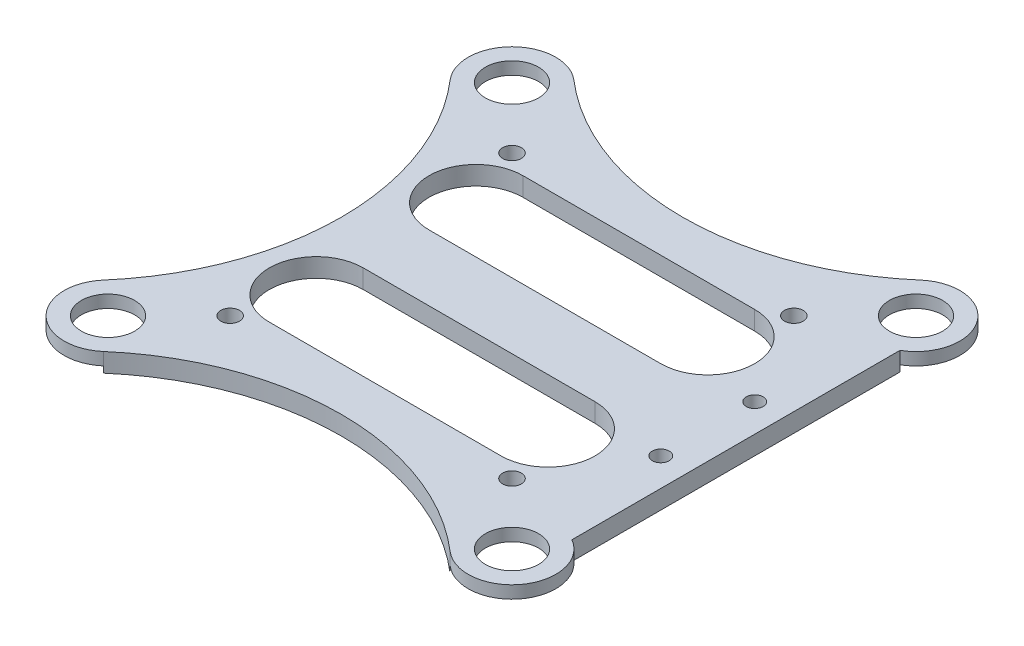
ISO-10303-21;
HEADER;
FILE_DESCRIPTION(('STEP AP214'),'2;1');
FILE_NAME('part.step','',(''),(''),'','','');
FILE_SCHEMA(('AUTOMOTIVE_DESIGN { 1 0 10303 214 1 1 1 1 }'));
ENDSEC;
DATA;
#1=APPLICATION_CONTEXT('core data for automotive mechanical design processes');
#2=APPLICATION_PROTOCOL_DEFINITION('international standard','automotive_design',2000,#1);
#3=PRODUCT_CONTEXT('',#1,'mechanical');
#4=PRODUCT('Part','Part','',(#3));
#5=PRODUCT_RELATED_PRODUCT_CATEGORY('part','',(#4));
#6=PRODUCT_DEFINITION_FORMATION('','',#4);
#7=PRODUCT_DEFINITION_CONTEXT('part definition',#1,'design');
#8=PRODUCT_DEFINITION('design','',#6,#7);
#9=PRODUCT_DEFINITION_SHAPE('','',#8);
#10=(LENGTH_UNIT() NAMED_UNIT(*) SI_UNIT(.MILLI.,.METRE.));
#11=(NAMED_UNIT(*) PLANE_ANGLE_UNIT() SI_UNIT($,.RADIAN.));
#12=(NAMED_UNIT(*) SI_UNIT($,.STERADIAN.) SOLID_ANGLE_UNIT());
#13=UNCERTAINTY_MEASURE_WITH_UNIT(LENGTH_MEASURE(1.E-05),#10,'distance_accuracy_value','');
#14=(GEOMETRIC_REPRESENTATION_CONTEXT(3) GLOBAL_UNCERTAINTY_ASSIGNED_CONTEXT((#13)) GLOBAL_UNIT_ASSIGNED_CONTEXT((#10,
#11,#12)) REPRESENTATION_CONTEXT('',''));
#15=CARTESIAN_POINT('',(0.,0.,0.));
#16=DIRECTION('',(0.,0.,1.));
#17=DIRECTION('',(1.,0.,0.));
#18=AXIS2_PLACEMENT_3D('',#15,#16,#17);
#19=CARTESIAN_POINT('',(-32.25,0.,-32.25));
#20=DIRECTION('',(0.,1.,0.));
#21=DIRECTION('',(0.,0.,1.));
#22=AXIS2_PLACEMENT_3D('',#19,#20,#21);
#23=CYLINDRICAL_SURFACE('',#22,7.);
#24=CARTESIAN_POINT('',(-32.25,0.,-32.25));
#25=DIRECTION('',(0.,1.,0.));
#26=DIRECTION('',(0.,0.,1.));
#27=AXIS2_PLACEMENT_3D('',#24,#25,#26);
#28=CIRCLE('',#27,7.);
#29=CARTESIAN_POINT('',(-27.6742280285036,0.,-37.5473871733967));
#30=VERTEX_POINT('',#29);
#31=CARTESIAN_POINT('',(-37.5473871733967,0.,-27.6742280285036));
#32=VERTEX_POINT('',#31);
#33=EDGE_CURVE('E353',#30,#32,#28,.F.);
#34=ORIENTED_EDGE('',*,*,#33,.T.);
#35=DIRECTION('',(0.,1.,0.));
#36=VECTOR('',#35,1.);
#37=CARTESIAN_POINT('',(-37.5473871733967,0.,-27.6742280285036));
#38=LINE('',#37,#36);
#39=CARTESIAN_POINT('',(-37.5473871733967,1.,-27.6742280285036));
#40=VERTEX_POINT('',#39);
#41=EDGE_CURVE('E231',#40,#32,#38,.F.);
#42=ORIENTED_EDGE('',*,*,#41,.F.);
#43=CARTESIAN_POINT('',(-32.25,1.,-32.25));
#44=DIRECTION('',(0.,1.,0.));
#45=DIRECTION('',(0.,0.,1.));
#46=AXIS2_PLACEMENT_3D('',#43,#44,#45);
#47=CIRCLE('',#46,7.);
#48=CARTESIAN_POINT('',(-27.6742280285036,1.,-37.5473871733967));
#49=VERTEX_POINT('',#48);
#50=EDGE_CURVE('E172',#49,#40,#47,.F.);
#51=ORIENTED_EDGE('',*,*,#50,.F.);
#52=DIRECTION('',(0.,1.,0.));
#53=VECTOR('',#52,1.);
#54=CARTESIAN_POINT('',(-27.6742280285036,0.,-37.5473871733967));
#55=LINE('',#54,#53);
#56=EDGE_CURVE('E164',#30,#49,#55,.T.);
#57=ORIENTED_EDGE('',*,*,#56,.F.);
#58=EDGE_LOOP('',(#34,#42,#51,#57));
#59=FACE_BOUND('',#58,.T.);
#60=ADVANCED_FACE('F17',(#59),#23,.F.);
#61=CARTESIAN_POINT('',(-32.25,0.,32.25));
#62=DIRECTION('',(0.,1.,0.));
#63=DIRECTION('',(0.,0.,1.));
#64=AXIS2_PLACEMENT_3D('',#61,#62,#63);
#65=CYLINDRICAL_SURFACE('',#64,7.);
#66=CARTESIAN_POINT('',(-32.25,1.,32.25));
#67=DIRECTION('',(0.,1.,0.));
#68=DIRECTION('',(0.,0.,1.));
#69=AXIS2_PLACEMENT_3D('',#66,#67,#68);
#70=CIRCLE('',#69,7.);
#71=CARTESIAN_POINT('',(-37.5473871733967,1.,27.6742280285035));
#72=VERTEX_POINT('',#71);
#73=CARTESIAN_POINT('',(-27.6742280285036,1.,37.5473871733967));
#74=VERTEX_POINT('',#73);
#75=EDGE_CURVE('E20',#72,#74,#70,.F.);
#76=ORIENTED_EDGE('',*,*,#75,.F.);
#77=DIRECTION('',(0.,1.,0.));
#78=VECTOR('',#77,1.);
#79=CARTESIAN_POINT('',(-37.5473871733967,0.,27.6742280285035));
#80=LINE('',#79,#78);
#81=CARTESIAN_POINT('',(-37.5473871733967,0.,27.6742280285035));
#82=VERTEX_POINT('',#81);
#83=EDGE_CURVE('E151',#82,#72,#80,.T.);
#84=ORIENTED_EDGE('',*,*,#83,.F.);
#85=CARTESIAN_POINT('',(-32.25,0.,32.25));
#86=DIRECTION('',(0.,1.,0.));
#87=DIRECTION('',(0.,0.,1.));
#88=AXIS2_PLACEMENT_3D('',#85,#86,#87);
#89=CIRCLE('',#88,7.);
#90=CARTESIAN_POINT('',(-27.6742280285036,0.,37.5473871733967));
#91=VERTEX_POINT('',#90);
#92=EDGE_CURVE('E351',#82,#91,#89,.F.);
#93=ORIENTED_EDGE('',*,*,#92,.T.);
#94=DIRECTION('',(0.,1.,0.));
#95=VECTOR('',#94,1.);
#96=CARTESIAN_POINT('',(-27.6742280285036,0.,37.5473871733967));
#97=LINE('',#96,#95);
#98=EDGE_CURVE('E163',#74,#91,#97,.F.);
#99=ORIENTED_EDGE('',*,*,#98,.F.);
#100=EDGE_LOOP('',(#76,#84,#93,#99));
#101=FACE_BOUND('',#100,.T.);
#102=ADVANCED_FACE('F169',(#101),#65,.F.);
#103=CARTESIAN_POINT('',(32.25,0.,32.25));
#104=DIRECTION('',(0.,1.,0.));
#105=DIRECTION('',(0.,0.,1.));
#106=AXIS2_PLACEMENT_3D('',#103,#104,#105);
#107=CYLINDRICAL_SURFACE('',#106,7.);
#108=CARTESIAN_POINT('',(32.25,1.,32.25));
#109=DIRECTION('',(0.,1.,0.));
#110=DIRECTION('',(0.,0.,1.));
#111=AXIS2_PLACEMENT_3D('',#108,#109,#110);
#112=CIRCLE('',#111,7.);
#113=CARTESIAN_POINT('',(27.6742280285036,1.,37.5473871733967));
#114=VERTEX_POINT('',#113);
#115=CARTESIAN_POINT('',(35.75,1.,26.1878221735089));
#116=VERTEX_POINT('',#115);
#117=EDGE_CURVE('E359',#114,#116,#112,.F.);
#118=ORIENTED_EDGE('',*,*,#117,.F.);
#119=DIRECTION('',(0.,1.,0.));
#120=VECTOR('',#119,1.);
#121=CARTESIAN_POINT('',(27.6742280285036,0.,37.5473871733967));
#122=LINE('',#121,#120);
#123=CARTESIAN_POINT('',(27.6742280285036,0.,37.5473871733967));
#124=VERTEX_POINT('',#123);
#125=EDGE_CURVE('E228',#124,#114,#122,.T.);
#126=ORIENTED_EDGE('',*,*,#125,.F.);
#127=CARTESIAN_POINT('',(32.25,0.,32.25));
#128=DIRECTION('',(0.,1.,0.));
#129=DIRECTION('',(0.,0.,1.));
#130=AXIS2_PLACEMENT_3D('',#127,#128,#129);
#131=CIRCLE('',#130,7.);
#132=CARTESIAN_POINT('',(35.75,0.,26.1878221735089));
#133=VERTEX_POINT('',#132);
#134=EDGE_CURVE('E348',#124,#133,#131,.F.);
#135=ORIENTED_EDGE('',*,*,#134,.T.);
#136=DIRECTION('',(0.,1.,0.));
#137=VECTOR('',#136,1.);
#138=CARTESIAN_POINT('',(35.75,0.,26.1878221735089));
#139=LINE('',#138,#137);
#140=EDGE_CURVE('E225',#116,#133,#139,.F.);
#141=ORIENTED_EDGE('',*,*,#140,.F.);
#142=EDGE_LOOP('',(#118,#126,#135,#141));
#143=FACE_BOUND('',#142,.T.);
#144=ADVANCED_FACE('F718',(#143),#107,.F.);
#145=CARTESIAN_POINT('',(32.25,0.,-32.25));
#146=DIRECTION('',(0.,1.,0.));
#147=DIRECTION('',(0.,0.,1.));
#148=AXIS2_PLACEMENT_3D('',#145,#146,#147);
#149=CYLINDRICAL_SURFACE('',#148,7.);
#150=CARTESIAN_POINT('',(32.25,0.,-32.25));
#151=DIRECTION('',(0.,1.,0.));
#152=DIRECTION('',(0.,0.,1.));
#153=AXIS2_PLACEMENT_3D('',#150,#151,#152);
#154=CIRCLE('',#153,7.);
#155=CARTESIAN_POINT('',(35.75,0.,-26.1878221735089));
#156=VERTEX_POINT('',#155);
#157=CARTESIAN_POINT('',(27.6742280285036,0.,-37.5473871733967));
#158=VERTEX_POINT('',#157);
#159=EDGE_CURVE('E222',#156,#158,#154,.F.);
#160=ORIENTED_EDGE('',*,*,#159,.T.);
#161=DIRECTION('',(0.,1.,0.));
#162=VECTOR('',#161,1.);
#163=CARTESIAN_POINT('',(27.6742280285036,0.,-37.5473871733967));
#164=LINE('',#163,#162);
#165=CARTESIAN_POINT('',(27.6742280285036,1.,-37.5473871733967));
#166=VERTEX_POINT('',#165);
#167=EDGE_CURVE('E223',#166,#158,#164,.F.);
#168=ORIENTED_EDGE('',*,*,#167,.F.);
#169=CARTESIAN_POINT('',(32.25,1.,-32.25));
#170=DIRECTION('',(0.,1.,0.));
#171=DIRECTION('',(0.,0.,1.));
#172=AXIS2_PLACEMENT_3D('',#169,#170,#171);
#173=CIRCLE('',#172,7.);
#174=CARTESIAN_POINT('',(35.75,1.,-26.1878221735089));
#175=VERTEX_POINT('',#174);
#176=EDGE_CURVE('E356',#175,#166,#173,.F.);
#177=ORIENTED_EDGE('',*,*,#176,.F.);
#178=DIRECTION('',(0.,1.,0.));
#179=VECTOR('',#178,1.);
#180=CARTESIAN_POINT('',(35.75,0.,-26.1878221735089));
#181=LINE('',#180,#179);
#182=EDGE_CURVE('E173',#156,#175,#181,.T.);
#183=ORIENTED_EDGE('',*,*,#182,.F.);
#184=EDGE_LOOP('',(#160,#168,#177,#183));
#185=FACE_BOUND('',#184,.T.);
#186=ADVANCED_FACE('F709',(#185),#149,.F.);
#187=CARTESIAN_POINT('',(-32.25,1.,32.25));
#188=DIRECTION('',(0.,-1.,0.));
#189=DIRECTION('',(0.,0.,-1.));
#190=AXIS2_PLACEMENT_3D('',#187,#188,#189);
#191=PLANE('',#190);
#192=CARTESIAN_POINT('',(-32.25,1.,32.25));
#193=DIRECTION('',(0.,1.,0.));
#194=DIRECTION('',(0.,0.,1.));
#195=AXIS2_PLACEMENT_3D('',#192,#193,#194);
#196=CIRCLE('',#195,4.25);
#197=CARTESIAN_POINT('',(-32.25,1.,36.5));
#198=VERTEX_POINT('',#197);
#199=EDGE_CURVE('E311',#198,#198,#196,.T.);
#200=ORIENTED_EDGE('',*,*,#199,.T.);
#201=EDGE_LOOP('',(#200));
#202=FACE_BOUND('',#201,.T.);
#203=ORIENTED_EDGE('',*,*,#75,.T.);
#204=CARTESIAN_POINT('',(-32.25,1.,32.25));
#205=DIRECTION('',(0.,1.,0.));
#206=DIRECTION('',(0.,0.,1.));
#207=AXIS2_PLACEMENT_3D('',#204,#205,#206);
#208=CIRCLE('',#207,7.);
#209=EDGE_CURVE('E174',#72,#74,#208,.T.);
#210=ORIENTED_EDGE('',*,*,#209,.F.);
#211=EDGE_LOOP('',(#203,#210));
#212=FACE_BOUND('',#211,.T.);
#213=ADVANCED_FACE('F175',(#202,#212),#191,.T.);
#214=CARTESIAN_POINT('',(-32.25,1.,-32.25));
#215=DIRECTION('',(0.,-1.,0.));
#216=DIRECTION('',(0.,0.,-1.));
#217=AXIS2_PLACEMENT_3D('',#214,#215,#216);
#218=PLANE('',#217);
#219=CARTESIAN_POINT('',(-32.25,1.,-32.25));
#220=DIRECTION('',(0.,1.,0.));
#221=DIRECTION('',(0.,0.,1.));
#222=AXIS2_PLACEMENT_3D('',#219,#220,#221);
#223=CIRCLE('',#222,4.25);
#224=CARTESIAN_POINT('',(-32.25,1.,-28.));
#225=VERTEX_POINT('',#224);
#226=EDGE_CURVE('E308',#225,#225,#223,.T.);
#227=ORIENTED_EDGE('',*,*,#226,.T.);
#228=EDGE_LOOP('',(#227));
#229=FACE_BOUND('',#228,.T.);
#230=ORIENTED_EDGE('',*,*,#50,.T.);
#231=CARTESIAN_POINT('',(-32.25,1.,-32.25));
#232=DIRECTION('',(0.,1.,0.));
#233=DIRECTION('',(0.,0.,1.));
#234=AXIS2_PLACEMENT_3D('',#231,#232,#233);
#235=CIRCLE('',#234,7.);
#236=EDGE_CURVE('E194',#49,#40,#235,.T.);
#237=ORIENTED_EDGE('',*,*,#236,.F.);
#238=EDGE_LOOP('',(#230,#237));
#239=FACE_BOUND('',#238,.T.);
#240=ADVANCED_FACE('F365',(#229,#239),#218,.T.);
#241=CARTESIAN_POINT('',(32.25,1.,32.25));
#242=DIRECTION('',(0.,-1.,0.));
#243=DIRECTION('',(0.,0.,-1.));
#244=AXIS2_PLACEMENT_3D('',#241,#242,#243);
#245=PLANE('',#244);
#246=CARTESIAN_POINT('',(32.25,1.,32.25));
#247=DIRECTION('',(0.,1.,0.));
#248=DIRECTION('',(0.,0.,1.));
#249=AXIS2_PLACEMENT_3D('',#246,#247,#248);
#250=CIRCLE('',#249,4.25);
#251=CARTESIAN_POINT('',(32.25,1.,36.5));
#252=VERTEX_POINT('',#251);
#253=EDGE_CURVE('E305',#252,#252,#250,.T.);
#254=ORIENTED_EDGE('',*,*,#253,.T.);
#255=EDGE_LOOP('',(#254));
#256=FACE_BOUND('',#255,.T.);
#257=CARTESIAN_POINT('',(32.25,1.,32.25));
#258=DIRECTION('',(0.,1.,0.));
#259=DIRECTION('',(0.,0.,1.));
#260=AXIS2_PLACEMENT_3D('',#257,#258,#259);
#261=CIRCLE('',#260,7.);
#262=EDGE_CURVE('E333',#114,#116,#261,.T.);
#263=ORIENTED_EDGE('',*,*,#262,.F.);
#264=ORIENTED_EDGE('',*,*,#117,.T.);
#265=EDGE_LOOP('',(#263,#264));
#266=FACE_BOUND('',#265,.T.);
#267=ADVANCED_FACE('F684',(#256,#266),#245,.T.);
#268=CARTESIAN_POINT('',(32.25,1.,-32.25));
#269=DIRECTION('',(0.,-1.,0.));
#270=DIRECTION('',(0.,0.,-1.));
#271=AXIS2_PLACEMENT_3D('',#268,#269,#270);
#272=PLANE('',#271);
#273=CARTESIAN_POINT('',(32.25,1.,-32.25));
#274=DIRECTION('',(0.,1.,0.));
#275=DIRECTION('',(0.,0.,1.));
#276=AXIS2_PLACEMENT_3D('',#273,#274,#275);
#277=CIRCLE('',#276,4.25);
#278=CARTESIAN_POINT('',(32.25,1.,-28.));
#279=VERTEX_POINT('',#278);
#280=EDGE_CURVE('E218',#279,#279,#277,.T.);
#281=ORIENTED_EDGE('',*,*,#280,.T.);
#282=EDGE_LOOP('',(#281));
#283=FACE_BOUND('',#282,.T.);
#284=CARTESIAN_POINT('',(32.25,1.,-32.25));
#285=DIRECTION('',(0.,1.,0.));
#286=DIRECTION('',(0.,0.,1.));
#287=AXIS2_PLACEMENT_3D('',#284,#285,#286);
#288=CIRCLE('',#287,7.);
#289=EDGE_CURVE('E201',#175,#166,#288,.T.);
#290=ORIENTED_EDGE('',*,*,#289,.F.);
#291=ORIENTED_EDGE('',*,*,#176,.T.);
#292=EDGE_LOOP('',(#290,#291));
#293=FACE_BOUND('',#292,.T.);
#294=ADVANCED_FACE('F675',(#283,#293),#272,.T.);
#295=CARTESIAN_POINT('',(0.,0.,0.));
#296=DIRECTION('',(0.,1.,0.));
#297=DIRECTION('',(0.,0.,1.));
#298=AXIS2_PLACEMENT_3D('',#295,#296,#297);
#299=PLANE('',#298);
#300=CARTESIAN_POINT('',(-18.5,0.,-12.75));
#301=DIRECTION('',(0.,-1.,0.));
#302=DIRECTION('',(0.,0.,-1.));
#303=AXIS2_PLACEMENT_3D('',#300,#301,#302);
#304=CIRCLE('',#303,7.5);
#305=CARTESIAN_POINT('',(-18.5,0.,-20.25));
#306=VERTEX_POINT('',#305);
#307=CARTESIAN_POINT('',(-18.5,0.,-5.25));
#308=VERTEX_POINT('',#307);
#309=EDGE_CURVE('E299',#306,#308,#304,.F.);
#310=ORIENTED_EDGE('',*,*,#309,.T.);
#311=DIRECTION('',(1.,0.,0.));
#312=VECTOR('',#311,1.);
#313=CARTESIAN_POINT('',(18.5,0.,-5.25));
#314=LINE('',#313,#312);
#315=CARTESIAN_POINT('',(18.5,0.,-5.25));
#316=VERTEX_POINT('',#315);
#317=EDGE_CURVE('E211',#308,#316,#314,.T.);
#318=ORIENTED_EDGE('',*,*,#317,.T.);
#319=CARTESIAN_POINT('',(18.5,0.,-12.75));
#320=DIRECTION('',(0.,-1.,0.));
#321=DIRECTION('',(0.,0.,-1.));
#322=AXIS2_PLACEMENT_3D('',#319,#320,#321);
#323=CIRCLE('',#322,7.5);
#324=CARTESIAN_POINT('',(18.5,0.,-20.25));
#325=VERTEX_POINT('',#324);
#326=EDGE_CURVE('E217',#316,#325,#323,.F.);
#327=ORIENTED_EDGE('',*,*,#326,.T.);
#328=DIRECTION('',(-1.,0.,0.));
#329=VECTOR('',#328,1.);
#330=CARTESIAN_POINT('',(-18.5,0.,-20.25));
#331=LINE('',#330,#329);
#332=EDGE_CURVE('E215',#325,#306,#331,.T.);
#333=ORIENTED_EDGE('',*,*,#332,.T.);
#334=EDGE_LOOP('',(#310,#318,#327,#333));
#335=FACE_BOUND('',#334,.T.);
#336=CARTESIAN_POINT('',(18.5,0.,12.75));
#337=DIRECTION('',(0.,1.,0.));
#338=DIRECTION('',(0.,0.,1.));
#339=AXIS2_PLACEMENT_3D('',#336,#337,#338);
#340=CIRCLE('',#339,7.5);
#341=CARTESIAN_POINT('',(18.5,0.,20.25));
#342=VERTEX_POINT('',#341);
#343=CARTESIAN_POINT('',(18.5,0.,5.25));
#344=VERTEX_POINT('',#343);
#345=EDGE_CURVE('E295',#342,#344,#340,.T.);
#346=ORIENTED_EDGE('',*,*,#345,.T.);
#347=DIRECTION('',(1.,0.,0.));
#348=VECTOR('',#347,1.);
#349=CARTESIAN_POINT('',(18.5,0.,5.25));
#350=LINE('',#349,#348);
#351=CARTESIAN_POINT('',(-18.5,0.,5.25));
#352=VERTEX_POINT('',#351);
#353=EDGE_CURVE('E202',#352,#344,#350,.T.);
#354=ORIENTED_EDGE('',*,*,#353,.F.);
#355=CARTESIAN_POINT('',(-18.5,0.,12.75));
#356=DIRECTION('',(0.,1.,0.));
#357=DIRECTION('',(0.,0.,1.));
#358=AXIS2_PLACEMENT_3D('',#355,#356,#357);
#359=CIRCLE('',#358,7.5);
#360=CARTESIAN_POINT('',(-18.5,0.,20.25));
#361=VERTEX_POINT('',#360);
#362=EDGE_CURVE('E209',#352,#361,#359,.T.);
#363=ORIENTED_EDGE('',*,*,#362,.T.);
#364=DIRECTION('',(-1.,0.,0.));
#365=VECTOR('',#364,1.);
#366=CARTESIAN_POINT('',(-18.5,0.,20.25));
#367=LINE('',#366,#365);
#368=EDGE_CURVE('E206',#342,#361,#367,.T.);
#369=ORIENTED_EDGE('',*,*,#368,.F.);
#370=EDGE_LOOP('',(#346,#354,#363,#369));
#371=FACE_BOUND('',#370,.T.);
#372=CARTESIAN_POINT('',(-22.5,0.,22.5));
#373=DIRECTION('',(0.,-1.,0.));
#374=DIRECTION('',(0.,0.,-1.));
#375=AXIS2_PLACEMENT_3D('',#372,#373,#374);
#376=CIRCLE('',#375,1.5);
#377=CARTESIAN_POINT('',(-22.5,0.,21.));
#378=VERTEX_POINT('',#377);
#379=EDGE_CURVE('E314',#378,#378,#376,.F.);
#380=ORIENTED_EDGE('',*,*,#379,.T.);
#381=EDGE_LOOP('',(#380));
#382=FACE_BOUND('',#381,.T.);
#383=CARTESIAN_POINT('',(31.25,0.,7.5));
#384=DIRECTION('',(0.,-1.,0.));
#385=DIRECTION('',(0.,0.,-1.));
#386=AXIS2_PLACEMENT_3D('',#383,#384,#385);
#387=CIRCLE('',#386,1.35);
#388=CARTESIAN_POINT('',(31.25,0.,6.15));
#389=VERTEX_POINT('',#388);
#390=EDGE_CURVE('E317',#389,#389,#387,.F.);
#391=ORIENTED_EDGE('',*,*,#390,.T.);
#392=EDGE_LOOP('',(#391));
#393=FACE_BOUND('',#392,.T.);
#394=CARTESIAN_POINT('',(22.5,0.,-22.5));
#395=DIRECTION('',(0.,-1.,0.));
#396=DIRECTION('',(0.,0.,-1.));
#397=AXIS2_PLACEMENT_3D('',#394,#395,#396);
#398=CIRCLE('',#397,1.5);
#399=CARTESIAN_POINT('',(22.5,0.,-24.));
#400=VERTEX_POINT('',#399);
#401=EDGE_CURVE('E320',#400,#400,#398,.F.);
#402=ORIENTED_EDGE('',*,*,#401,.T.);
#403=EDGE_LOOP('',(#402));
#404=FACE_BOUND('',#403,.T.);
#405=CARTESIAN_POINT('',(-22.5,0.,-22.5));
#406=DIRECTION('',(0.,-1.,0.));
#407=DIRECTION('',(0.,0.,-1.));
#408=AXIS2_PLACEMENT_3D('',#405,#406,#407);
#409=CIRCLE('',#408,1.5);
#410=CARTESIAN_POINT('',(-22.5,0.,-24.));
#411=VERTEX_POINT('',#410);
#412=EDGE_CURVE('E323',#411,#411,#409,.F.);
#413=ORIENTED_EDGE('',*,*,#412,.T.);
#414=EDGE_LOOP('',(#413));
#415=FACE_BOUND('',#414,.T.);
#416=CARTESIAN_POINT('',(31.25,0.,-7.5));
#417=DIRECTION('',(0.,-1.,0.));
#418=DIRECTION('',(0.,0.,-1.));
#419=AXIS2_PLACEMENT_3D('',#416,#417,#418);
#420=CIRCLE('',#419,1.35);
#421=CARTESIAN_POINT('',(31.25,0.,-8.85));
#422=VERTEX_POINT('',#421);
#423=EDGE_CURVE('E326',#422,#422,#420,.F.);
#424=ORIENTED_EDGE('',*,*,#423,.T.);
#425=EDGE_LOOP('',(#424));
#426=FACE_BOUND('',#425,.T.);
#427=CARTESIAN_POINT('',(22.5,0.,22.5));
#428=DIRECTION('',(0.,-1.,0.));
#429=DIRECTION('',(0.,0.,-1.));
#430=AXIS2_PLACEMENT_3D('',#427,#428,#429);
#431=CIRCLE('',#430,1.5);
#432=CARTESIAN_POINT('',(22.5,0.,21.));
#433=VERTEX_POINT('',#432);
#434=EDGE_CURVE('E329',#433,#433,#431,.F.);
#435=ORIENTED_EDGE('',*,*,#434,.T.);
#436=EDGE_LOOP('',(#435));
#437=FACE_BOUND('',#436,.T.);
#438=DIRECTION('',(0.,0.,-1.));
#439=VECTOR('',#438,1.);
#440=CARTESIAN_POINT('',(35.75,0.,-25.4452537322779));
#441=LINE('',#440,#439);
#442=EDGE_CURVE('E219',#133,#156,#441,.T.);
#443=ORIENTED_EDGE('',*,*,#442,.F.);
#444=ORIENTED_EDGE('',*,*,#134,.F.);
#445=CARTESIAN_POINT('',(0.,0.,69.5859375));
#446=DIRECTION('',(0.,1.,0.));
#447=DIRECTION('',(0.,0.,1.));
#448=AXIS2_PLACEMENT_3D('',#445,#446,#447);
#449=CIRCLE('',#448,42.3359375);
#450=EDGE_CURVE('E185',#124,#91,#449,.T.);
#451=ORIENTED_EDGE('',*,*,#450,.T.);
#452=ORIENTED_EDGE('',*,*,#92,.F.);
#453=CARTESIAN_POINT('',(-69.5859375,0.,0.));
#454=DIRECTION('',(0.,1.,0.));
#455=DIRECTION('',(0.,0.,1.));
#456=AXIS2_PLACEMENT_3D('',#453,#454,#455);
#457=CIRCLE('',#456,42.3359375);
#458=EDGE_CURVE('E159',#82,#32,#457,.T.);
#459=ORIENTED_EDGE('',*,*,#458,.T.);
#460=ORIENTED_EDGE('',*,*,#33,.F.);
#461=CARTESIAN_POINT('',(0.,0.,-69.5859375));
#462=DIRECTION('',(0.,1.,0.));
#463=DIRECTION('',(0.,0.,1.));
#464=AXIS2_PLACEMENT_3D('',#461,#462,#463);
#465=CIRCLE('',#464,42.3359375);
#466=EDGE_CURVE('E197',#30,#158,#465,.T.);
#467=ORIENTED_EDGE('',*,*,#466,.T.);
#468=ORIENTED_EDGE('',*,*,#159,.F.);
#469=EDGE_LOOP('',(#443,#444,#451,#452,#459,#460,#467,#468));
#470=FACE_BOUND('',#469,.T.);
#471=ADVANCED_FACE('F383',(#335,#371,#382,#393,#404,#415,#426,#437,#470),#299,.F.);
#472=CARTESIAN_POINT('',(35.75,3.,-25.4452537322779));
#473=DIRECTION('',(1.,0.,0.));
#474=DIRECTION('',(0.,0.,-1.));
#475=AXIS2_PLACEMENT_3D('',#472,#473,#474);
#476=PLANE('',#475);
#477=DIRECTION('',(0.,1.,0.));
#478=VECTOR('',#477,1.);
#479=CARTESIAN_POINT('',(35.75,0.,26.1878221735089));
#480=LINE('',#479,#478);
#481=CARTESIAN_POINT('',(35.75,3.,26.1878221735089));
#482=VERTEX_POINT('',#481);
#483=EDGE_CURVE('E336',#116,#482,#480,.T.);
#484=ORIENTED_EDGE('',*,*,#483,.F.);
#485=ORIENTED_EDGE('',*,*,#140,.T.);
#486=ORIENTED_EDGE('',*,*,#442,.T.);
#487=ORIENTED_EDGE('',*,*,#182,.T.);
#488=DIRECTION('',(0.,1.,0.));
#489=VECTOR('',#488,1.);
#490=CARTESIAN_POINT('',(35.75,0.,-26.1878221735089));
#491=LINE('',#490,#489);
#492=CARTESIAN_POINT('',(35.75,3.,-26.1878221735089));
#493=VERTEX_POINT('',#492);
#494=EDGE_CURVE('E198',#493,#175,#491,.F.);
#495=ORIENTED_EDGE('',*,*,#494,.F.);
#496=DIRECTION('',(0.,0.,1.));
#497=VECTOR('',#496,1.);
#498=CARTESIAN_POINT('',(35.75,3.,0.));
#499=LINE('',#498,#497);
#500=EDGE_CURVE('E294',#482,#493,#499,.F.);
#501=ORIENTED_EDGE('',*,*,#500,.F.);
#502=EDGE_LOOP('',(#484,#485,#486,#487,#495,#501));
#503=FACE_BOUND('',#502,.T.);
#504=ADVANCED_FACE('F659',(#503),#476,.T.);
#505=CARTESIAN_POINT('',(32.25,0.,-32.25));
#506=DIRECTION('',(0.,1.,0.));
#507=DIRECTION('',(0.,0.,1.));
#508=AXIS2_PLACEMENT_3D('',#505,#506,#507);
#509=CYLINDRICAL_SURFACE('',#508,7.);
#510=CARTESIAN_POINT('',(32.25,3.,-32.25));
#511=DIRECTION('',(0.,1.,0.));
#512=DIRECTION('',(0.,0.,1.));
#513=AXIS2_PLACEMENT_3D('',#510,#511,#512);
#514=CIRCLE('',#513,7.);
#515=CARTESIAN_POINT('',(27.6742280285036,3.,-37.5473871733967));
#516=VERTEX_POINT('',#515);
#517=EDGE_CURVE('E291',#493,#516,#514,.T.);
#518=ORIENTED_EDGE('',*,*,#517,.F.);
#519=ORIENTED_EDGE('',*,*,#494,.T.);
#520=ORIENTED_EDGE('',*,*,#289,.T.);
#521=DIRECTION('',(0.,1.,0.));
#522=VECTOR('',#521,1.);
#523=CARTESIAN_POINT('',(27.6742280285036,0.,-37.5473871733967));
#524=LINE('',#523,#522);
#525=EDGE_CURVE('E195',#166,#516,#524,.T.);
#526=ORIENTED_EDGE('',*,*,#525,.T.);
#527=EDGE_LOOP('',(#518,#519,#520,#526));
#528=FACE_BOUND('',#527,.T.);
#529=ADVANCED_FACE('F651',(#528),#509,.T.);
#530=CARTESIAN_POINT('',(0.,0.,-69.5859375));
#531=DIRECTION('',(0.,1.,0.));
#532=DIRECTION('',(0.,0.,1.));
#533=AXIS2_PLACEMENT_3D('',#530,#531,#532);
#534=CYLINDRICAL_SURFACE('',#533,42.3359375);
#535=ORIENTED_EDGE('',*,*,#56,.T.);
#536=DIRECTION('',(0.,1.,0.));
#537=VECTOR('',#536,1.);
#538=CARTESIAN_POINT('',(-27.6742280285036,0.,-37.5473871733967));
#539=LINE('',#538,#537);
#540=CARTESIAN_POINT('',(-27.6742280285036,3.,-37.5473871733967));
#541=VERTEX_POINT('',#540);
#542=EDGE_CURVE('E191',#541,#49,#539,.F.);
#543=ORIENTED_EDGE('',*,*,#542,.F.);
#544=CARTESIAN_POINT('',(0.,3.,-69.5859375));
#545=DIRECTION('',(0.,1.,0.));
#546=DIRECTION('',(0.,0.,1.));
#547=AXIS2_PLACEMENT_3D('',#544,#545,#546);
#548=CIRCLE('',#547,42.3359375);
#549=EDGE_CURVE('E288',#516,#541,#548,.F.);
#550=ORIENTED_EDGE('',*,*,#549,.F.);
#551=ORIENTED_EDGE('',*,*,#525,.F.);
#552=ORIENTED_EDGE('',*,*,#167,.T.);
#553=ORIENTED_EDGE('',*,*,#466,.F.);
#554=EDGE_LOOP('',(#535,#543,#550,#551,#552,#553));
#555=FACE_BOUND('',#554,.T.);
#556=ADVANCED_FACE('F378',(#555),#534,.F.);
#557=CARTESIAN_POINT('',(-32.25,0.,-32.25));
#558=DIRECTION('',(0.,1.,0.));
#559=DIRECTION('',(0.,0.,1.));
#560=AXIS2_PLACEMENT_3D('',#557,#558,#559);
#561=CYLINDRICAL_SURFACE('',#560,7.);
#562=CARTESIAN_POINT('',(-32.25,3.,-32.25));
#563=DIRECTION('',(0.,1.,0.));
#564=DIRECTION('',(0.,0.,1.));
#565=AXIS2_PLACEMENT_3D('',#562,#563,#564);
#566=CIRCLE('',#565,7.);
#567=CARTESIAN_POINT('',(-37.5473871733967,3.,-27.6742280285036));
#568=VERTEX_POINT('',#567);
#569=EDGE_CURVE('E285',#541,#568,#566,.T.);
#570=ORIENTED_EDGE('',*,*,#569,.F.);
#571=ORIENTED_EDGE('',*,*,#542,.T.);
#572=ORIENTED_EDGE('',*,*,#236,.T.);
#573=DIRECTION('',(0.,1.,0.));
#574=VECTOR('',#573,1.);
#575=CARTESIAN_POINT('',(-37.5473871733967,0.,-27.6742280285036));
#576=LINE('',#575,#574);
#577=EDGE_CURVE('E189',#40,#568,#576,.T.);
#578=ORIENTED_EDGE('',*,*,#577,.T.);
#579=EDGE_LOOP('',(#570,#571,#572,#578));
#580=FACE_BOUND('',#579,.T.);
#581=ADVANCED_FACE('F370',(#580),#561,.T.);
#582=CARTESIAN_POINT('',(-69.5859375,0.,0.));
#583=DIRECTION('',(0.,1.,0.));
#584=DIRECTION('',(0.,0.,1.));
#585=AXIS2_PLACEMENT_3D('',#582,#583,#584);
#586=CYLINDRICAL_SURFACE('',#585,42.3359375);
#587=ORIENTED_EDGE('',*,*,#83,.T.);
#588=DIRECTION('',(0.,1.,0.));
#589=VECTOR('',#588,1.);
#590=CARTESIAN_POINT('',(-37.5473871733967,0.,27.6742280285035));
#591=LINE('',#590,#589);
#592=CARTESIAN_POINT('',(-37.5473871733967,3.,27.6742280285035));
#593=VERTEX_POINT('',#592);
#594=EDGE_CURVE('E156',#593,#72,#591,.F.);
#595=ORIENTED_EDGE('',*,*,#594,.F.);
#596=CARTESIAN_POINT('',(-69.5859375,3.,0.));
#597=DIRECTION('',(0.,1.,0.));
#598=DIRECTION('',(0.,0.,1.));
#599=AXIS2_PLACEMENT_3D('',#596,#597,#598);
#600=CIRCLE('',#599,42.3359375);
#601=EDGE_CURVE('E283',#568,#593,#600,.F.);
#602=ORIENTED_EDGE('',*,*,#601,.F.);
#603=ORIENTED_EDGE('',*,*,#577,.F.);
#604=ORIENTED_EDGE('',*,*,#41,.T.);
#605=ORIENTED_EDGE('',*,*,#458,.F.);
#606=EDGE_LOOP('',(#587,#595,#602,#603,#604,#605));
#607=FACE_BOUND('',#606,.T.);
#608=ADVANCED_FACE('F153',(#607),#586,.F.);
#609=CARTESIAN_POINT('',(-32.25,0.,32.25));
#610=DIRECTION('',(0.,1.,0.));
#611=DIRECTION('',(0.,0.,1.));
#612=AXIS2_PLACEMENT_3D('',#609,#610,#611);
#613=CYLINDRICAL_SURFACE('',#612,7.);
#614=CARTESIAN_POINT('',(-32.25,3.,32.25));
#615=DIRECTION('',(0.,1.,0.));
#616=DIRECTION('',(0.,0.,1.));
#617=AXIS2_PLACEMENT_3D('',#614,#615,#616);
#618=CIRCLE('',#617,7.);
#619=CARTESIAN_POINT('',(-27.6742280285036,3.,37.5473871733967));
#620=VERTEX_POINT('',#619);
#621=EDGE_CURVE('E181',#593,#620,#618,.T.);
#622=ORIENTED_EDGE('',*,*,#621,.F.);
#623=ORIENTED_EDGE('',*,*,#594,.T.);
#624=ORIENTED_EDGE('',*,*,#209,.T.);
#625=DIRECTION('',(0.,1.,0.));
#626=VECTOR('',#625,1.);
#627=CARTESIAN_POINT('',(-27.6742280285036,0.,37.5473871733967));
#628=LINE('',#627,#626);
#629=EDGE_CURVE('E183',#74,#620,#628,.T.);
#630=ORIENTED_EDGE('',*,*,#629,.T.);
#631=EDGE_LOOP('',(#622,#623,#624,#630));
#632=FACE_BOUND('',#631,.T.);
#633=ADVANCED_FACE('F179',(#632),#613,.T.);
#634=CARTESIAN_POINT('',(0.,0.,69.5859375));
#635=DIRECTION('',(0.,1.,0.));
#636=DIRECTION('',(0.,0.,1.));
#637=AXIS2_PLACEMENT_3D('',#634,#635,#636);
#638=CYLINDRICAL_SURFACE('',#637,42.3359375);
#639=ORIENTED_EDGE('',*,*,#125,.T.);
#640=DIRECTION('',(0.,1.,0.));
#641=VECTOR('',#640,1.);
#642=CARTESIAN_POINT('',(27.6742280285036,0.,37.5473871733967));
#643=LINE('',#642,#641);
#644=CARTESIAN_POINT('',(27.6742280285036,3.,37.5473871733967));
#645=VERTEX_POINT('',#644);
#646=EDGE_CURVE('E332',#645,#114,#643,.F.);
#647=ORIENTED_EDGE('',*,*,#646,.F.);
#648=CARTESIAN_POINT('',(0.,3.,69.5859375));
#649=DIRECTION('',(0.,1.,0.));
#650=DIRECTION('',(0.,0.,1.));
#651=AXIS2_PLACEMENT_3D('',#648,#649,#650);
#652=CIRCLE('',#651,42.3359375);
#653=EDGE_CURVE('E279',#620,#645,#652,.F.);
#654=ORIENTED_EDGE('',*,*,#653,.F.);
#655=ORIENTED_EDGE('',*,*,#629,.F.);
#656=ORIENTED_EDGE('',*,*,#98,.T.);
#657=ORIENTED_EDGE('',*,*,#450,.F.);
#658=EDGE_LOOP('',(#639,#647,#654,#655,#656,#657));
#659=FACE_BOUND('',#658,.T.);
#660=ADVANCED_FACE('F388',(#659),#638,.F.);
#661=CARTESIAN_POINT('',(32.25,0.,32.25));
#662=DIRECTION('',(0.,1.,0.));
#663=DIRECTION('',(0.,0.,1.));
#664=AXIS2_PLACEMENT_3D('',#661,#662,#663);
#665=CYLINDRICAL_SURFACE('',#664,7.);
#666=CARTESIAN_POINT('',(32.25,3.,32.25));
#667=DIRECTION('',(0.,1.,0.));
#668=DIRECTION('',(0.,0.,1.));
#669=AXIS2_PLACEMENT_3D('',#666,#667,#668);
#670=CIRCLE('',#669,7.);
#671=EDGE_CURVE('E276',#645,#482,#670,.T.);
#672=ORIENTED_EDGE('',*,*,#671,.F.);
#673=ORIENTED_EDGE('',*,*,#646,.T.);
#674=ORIENTED_EDGE('',*,*,#262,.T.);
#675=ORIENTED_EDGE('',*,*,#483,.T.);
#676=EDGE_LOOP('',(#672,#673,#674,#675));
#677=FACE_BOUND('',#676,.T.);
#678=ADVANCED_FACE('F395',(#677),#665,.T.);
#679=CARTESIAN_POINT('',(22.5,3.,22.5));
#680=DIRECTION('',(0.,-1.,0.));
#681=DIRECTION('',(0.,0.,-1.));
#682=AXIS2_PLACEMENT_3D('',#679,#680,#681);
#683=CYLINDRICAL_SURFACE('',#682,1.5);
#684=ORIENTED_EDGE('',*,*,#434,.F.);
#685=EDGE_LOOP('',(#684));
#686=FACE_BOUND('',#685,.T.);
#687=CARTESIAN_POINT('',(22.5,3.,22.5));
#688=DIRECTION('',(0.,-1.,0.));
#689=DIRECTION('',(0.,0.,-1.));
#690=AXIS2_PLACEMENT_3D('',#687,#688,#689);
#691=CIRCLE('',#690,1.5);
#692=CARTESIAN_POINT('',(22.5,3.,21.));
#693=VERTEX_POINT('',#692);
#694=EDGE_CURVE('E273',#693,#693,#691,.T.);
#695=ORIENTED_EDGE('',*,*,#694,.F.);
#696=EDGE_LOOP('',(#695));
#697=FACE_BOUND('',#696,.T.);
#698=ADVANCED_FACE('F599',(#686,#697),#683,.F.);
#699=CARTESIAN_POINT('',(31.25,3.,-7.5));
#700=DIRECTION('',(0.,-1.,0.));
#701=DIRECTION('',(0.,0.,-1.));
#702=AXIS2_PLACEMENT_3D('',#699,#700,#701);
#703=CYLINDRICAL_SURFACE('',#702,1.35);
#704=ORIENTED_EDGE('',*,*,#423,.F.);
#705=EDGE_LOOP('',(#704));
#706=FACE_BOUND('',#705,.T.);
#707=CARTESIAN_POINT('',(31.25,3.,-7.5));
#708=DIRECTION('',(0.,-1.,0.));
#709=DIRECTION('',(0.,0.,-1.));
#710=AXIS2_PLACEMENT_3D('',#707,#708,#709);
#711=CIRCLE('',#710,1.35);
#712=CARTESIAN_POINT('',(31.25,3.,-8.85));
#713=VERTEX_POINT('',#712);
#714=EDGE_CURVE('E270',#713,#713,#711,.T.);
#715=ORIENTED_EDGE('',*,*,#714,.F.);
#716=EDGE_LOOP('',(#715));
#717=FACE_BOUND('',#716,.T.);
#718=ADVANCED_FACE('F590',(#706,#717),#703,.F.);
#719=CARTESIAN_POINT('',(-22.5,3.,-22.5));
#720=DIRECTION('',(0.,-1.,0.));
#721=DIRECTION('',(0.,0.,-1.));
#722=AXIS2_PLACEMENT_3D('',#719,#720,#721);
#723=CYLINDRICAL_SURFACE('',#722,1.5);
#724=ORIENTED_EDGE('',*,*,#412,.F.);
#725=EDGE_LOOP('',(#724));
#726=FACE_BOUND('',#725,.T.);
#727=CARTESIAN_POINT('',(-22.5,3.,-22.5));
#728=DIRECTION('',(0.,-1.,0.));
#729=DIRECTION('',(0.,0.,-1.));
#730=AXIS2_PLACEMENT_3D('',#727,#728,#729);
#731=CIRCLE('',#730,1.5);
#732=CARTESIAN_POINT('',(-22.5,3.,-24.));
#733=VERTEX_POINT('',#732);
#734=EDGE_CURVE('E267',#733,#733,#731,.T.);
#735=ORIENTED_EDGE('',*,*,#734,.F.);
#736=EDGE_LOOP('',(#735));
#737=FACE_BOUND('',#736,.T.);
#738=ADVANCED_FACE('F581',(#726,#737),#723,.F.);
#739=CARTESIAN_POINT('',(22.5,3.,-22.5));
#740=DIRECTION('',(0.,-1.,0.));
#741=DIRECTION('',(0.,0.,-1.));
#742=AXIS2_PLACEMENT_3D('',#739,#740,#741);
#743=CYLINDRICAL_SURFACE('',#742,1.5);
#744=ORIENTED_EDGE('',*,*,#401,.F.);
#745=EDGE_LOOP('',(#744));
#746=FACE_BOUND('',#745,.T.);
#747=CARTESIAN_POINT('',(22.5,3.,-22.5));
#748=DIRECTION('',(0.,-1.,0.));
#749=DIRECTION('',(0.,0.,-1.));
#750=AXIS2_PLACEMENT_3D('',#747,#748,#749);
#751=CIRCLE('',#750,1.5);
#752=CARTESIAN_POINT('',(22.5,3.,-24.));
#753=VERTEX_POINT('',#752);
#754=EDGE_CURVE('E264',#753,#753,#751,.T.);
#755=ORIENTED_EDGE('',*,*,#754,.F.);
#756=EDGE_LOOP('',(#755));
#757=FACE_BOUND('',#756,.T.);
#758=ADVANCED_FACE('F572',(#746,#757),#743,.F.);
#759=CARTESIAN_POINT('',(31.25,3.,7.5));
#760=DIRECTION('',(0.,-1.,0.));
#761=DIRECTION('',(0.,0.,-1.));
#762=AXIS2_PLACEMENT_3D('',#759,#760,#761);
#763=CYLINDRICAL_SURFACE('',#762,1.35);
#764=ORIENTED_EDGE('',*,*,#390,.F.);
#765=EDGE_LOOP('',(#764));
#766=FACE_BOUND('',#765,.T.);
#767=CARTESIAN_POINT('',(31.25,3.,7.5));
#768=DIRECTION('',(0.,-1.,0.));
#769=DIRECTION('',(0.,0.,-1.));
#770=AXIS2_PLACEMENT_3D('',#767,#768,#769);
#771=CIRCLE('',#770,1.35);
#772=CARTESIAN_POINT('',(31.25,3.,6.15));
#773=VERTEX_POINT('',#772);
#774=EDGE_CURVE('E261',#773,#773,#771,.T.);
#775=ORIENTED_EDGE('',*,*,#774,.F.);
#776=EDGE_LOOP('',(#775));
#777=FACE_BOUND('',#776,.T.);
#778=ADVANCED_FACE('F563',(#766,#777),#763,.F.);
#779=CARTESIAN_POINT('',(-22.5,3.,22.5));
#780=DIRECTION('',(0.,-1.,0.));
#781=DIRECTION('',(0.,0.,-1.));
#782=AXIS2_PLACEMENT_3D('',#779,#780,#781);
#783=CYLINDRICAL_SURFACE('',#782,1.5);
#784=ORIENTED_EDGE('',*,*,#379,.F.);
#785=EDGE_LOOP('',(#784));
#786=FACE_BOUND('',#785,.T.);
#787=CARTESIAN_POINT('',(-22.5,3.,22.5));
#788=DIRECTION('',(0.,-1.,0.));
#789=DIRECTION('',(0.,0.,-1.));
#790=AXIS2_PLACEMENT_3D('',#787,#788,#789);
#791=CIRCLE('',#790,1.5);
#792=CARTESIAN_POINT('',(-22.5,3.,21.));
#793=VERTEX_POINT('',#792);
#794=EDGE_CURVE('E258',#793,#793,#791,.T.);
#795=ORIENTED_EDGE('',*,*,#794,.F.);
#796=EDGE_LOOP('',(#795));
#797=FACE_BOUND('',#796,.T.);
#798=ADVANCED_FACE('F554',(#786,#797),#783,.F.);
#799=CARTESIAN_POINT('',(-32.25,0.,32.25));
#800=DIRECTION('',(0.,1.,0.));
#801=DIRECTION('',(0.,0.,1.));
#802=AXIS2_PLACEMENT_3D('',#799,#800,#801);
#803=CYLINDRICAL_SURFACE('',#802,4.25);
#804=ORIENTED_EDGE('',*,*,#199,.F.);
#805=EDGE_LOOP('',(#804));
#806=FACE_BOUND('',#805,.T.);
#807=CARTESIAN_POINT('',(-32.25,3.,32.25));
#808=DIRECTION('',(0.,1.,0.));
#809=DIRECTION('',(0.,0.,1.));
#810=AXIS2_PLACEMENT_3D('',#807,#808,#809);
#811=CIRCLE('',#810,4.25);
#812=CARTESIAN_POINT('',(-32.25,3.,36.5));
#813=VERTEX_POINT('',#812);
#814=EDGE_CURVE('E255',#813,#813,#811,.F.);
#815=ORIENTED_EDGE('',*,*,#814,.F.);
#816=EDGE_LOOP('',(#815));
#817=FACE_BOUND('',#816,.T.);
#818=ADVANCED_FACE('F545',(#806,#817),#803,.F.);
#819=CARTESIAN_POINT('',(-32.25,0.,-32.25));
#820=DIRECTION('',(0.,1.,0.));
#821=DIRECTION('',(0.,0.,1.));
#822=AXIS2_PLACEMENT_3D('',#819,#820,#821);
#823=CYLINDRICAL_SURFACE('',#822,4.25);
#824=ORIENTED_EDGE('',*,*,#226,.F.);
#825=EDGE_LOOP('',(#824));
#826=FACE_BOUND('',#825,.T.);
#827=CARTESIAN_POINT('',(-32.25,3.,-32.25));
#828=DIRECTION('',(0.,1.,0.));
#829=DIRECTION('',(0.,0.,1.));
#830=AXIS2_PLACEMENT_3D('',#827,#828,#829);
#831=CIRCLE('',#830,4.25);
#832=CARTESIAN_POINT('',(-32.25,3.,-28.));
#833=VERTEX_POINT('',#832);
#834=EDGE_CURVE('E252',#833,#833,#831,.F.);
#835=ORIENTED_EDGE('',*,*,#834,.F.);
#836=EDGE_LOOP('',(#835));
#837=FACE_BOUND('',#836,.T.);
#838=ADVANCED_FACE('F536',(#826,#837),#823,.F.);
#839=CARTESIAN_POINT('',(32.25,0.,32.25));
#840=DIRECTION('',(0.,1.,0.));
#841=DIRECTION('',(0.,0.,1.));
#842=AXIS2_PLACEMENT_3D('',#839,#840,#841);
#843=CYLINDRICAL_SURFACE('',#842,4.25);
#844=ORIENTED_EDGE('',*,*,#253,.F.);
#845=EDGE_LOOP('',(#844));
#846=FACE_BOUND('',#845,.T.);
#847=CARTESIAN_POINT('',(32.25,3.,32.25));
#848=DIRECTION('',(0.,1.,0.));
#849=DIRECTION('',(0.,0.,1.));
#850=AXIS2_PLACEMENT_3D('',#847,#848,#849);
#851=CIRCLE('',#850,4.25);
#852=CARTESIAN_POINT('',(32.25,3.,36.5));
#853=VERTEX_POINT('',#852);
#854=EDGE_CURVE('E249',#853,#853,#851,.F.);
#855=ORIENTED_EDGE('',*,*,#854,.F.);
#856=EDGE_LOOP('',(#855));
#857=FACE_BOUND('',#856,.T.);
#858=ADVANCED_FACE('F527',(#846,#857),#843,.F.);
#859=CARTESIAN_POINT('',(32.25,0.,-32.25));
#860=DIRECTION('',(0.,1.,0.));
#861=DIRECTION('',(0.,0.,1.));
#862=AXIS2_PLACEMENT_3D('',#859,#860,#861);
#863=CYLINDRICAL_SURFACE('',#862,4.25);
#864=ORIENTED_EDGE('',*,*,#280,.F.);
#865=EDGE_LOOP('',(#864));
#866=FACE_BOUND('',#865,.T.);
#867=CARTESIAN_POINT('',(32.25,3.,-32.25));
#868=DIRECTION('',(0.,1.,0.));
#869=DIRECTION('',(0.,0.,1.));
#870=AXIS2_PLACEMENT_3D('',#867,#868,#869);
#871=CIRCLE('',#870,4.25);
#872=CARTESIAN_POINT('',(32.25,3.,-28.));
#873=VERTEX_POINT('',#872);
#874=EDGE_CURVE('E246',#873,#873,#871,.F.);
#875=ORIENTED_EDGE('',*,*,#874,.F.);
#876=EDGE_LOOP('',(#875));
#877=FACE_BOUND('',#876,.T.);
#878=ADVANCED_FACE('F518',(#866,#877),#863,.F.);
#879=CARTESIAN_POINT('',(-18.5,3.,-20.25));
#880=DIRECTION('',(0.,0.,-1.));
#881=DIRECTION('',(-1.,0.,0.));
#882=AXIS2_PLACEMENT_3D('',#879,#880,#881);
#883=PLANE('',#882);
#884=DIRECTION('',(0.,-1.,0.));
#885=VECTOR('',#884,1.);
#886=CARTESIAN_POINT('',(-18.5,3.,-20.25));
#887=LINE('',#886,#885);
#888=CARTESIAN_POINT('',(-18.5,3.,-20.25));
#889=VERTEX_POINT('',#888);
#890=EDGE_CURVE('E301',#889,#306,#887,.T.);
#891=ORIENTED_EDGE('',*,*,#890,.T.);
#892=ORIENTED_EDGE('',*,*,#332,.F.);
#893=DIRECTION('',(0.,-1.,0.));
#894=VECTOR('',#893,1.);
#895=CARTESIAN_POINT('',(18.5,3.,-20.25));
#896=LINE('',#895,#894);
#897=CARTESIAN_POINT('',(18.5,3.,-20.25));
#898=VERTEX_POINT('',#897);
#899=EDGE_CURVE('E214',#325,#898,#896,.F.);
#900=ORIENTED_EDGE('',*,*,#899,.T.);
#901=DIRECTION('',(1.,0.,0.));
#902=VECTOR('',#901,1.);
#903=CARTESIAN_POINT('',(0.,3.,-20.25));
#904=LINE('',#903,#902);
#905=EDGE_CURVE('E245',#889,#898,#904,.T.);
#906=ORIENTED_EDGE('',*,*,#905,.F.);
#907=EDGE_LOOP('',(#891,#892,#900,#906));
#908=FACE_BOUND('',#907,.T.);
#909=ADVANCED_FACE('F509',(#908),#883,.F.);
#910=CARTESIAN_POINT('',(18.5,3.,-12.75));
#911=DIRECTION('',(0.,-1.,0.));
#912=DIRECTION('',(0.,0.,-1.));
#913=AXIS2_PLACEMENT_3D('',#910,#911,#912);
#914=CYLINDRICAL_SURFACE('',#913,7.5);
#915=ORIENTED_EDGE('',*,*,#899,.F.);
#916=ORIENTED_EDGE('',*,*,#326,.F.);
#917=DIRECTION('',(0.,1.,0.));
#918=VECTOR('',#917,1.);
#919=CARTESIAN_POINT('',(18.5,3.,-5.25));
#920=LINE('',#919,#918);
#921=CARTESIAN_POINT('',(18.5,3.,-5.25));
#922=VERTEX_POINT('',#921);
#923=EDGE_CURVE('E213',#316,#922,#920,.T.);
#924=ORIENTED_EDGE('',*,*,#923,.T.);
#925=CARTESIAN_POINT('',(18.5,3.,-12.75));
#926=DIRECTION('',(0.,-1.,0.));
#927=DIRECTION('',(0.,0.,-1.));
#928=AXIS2_PLACEMENT_3D('',#925,#926,#927);
#929=CIRCLE('',#928,7.5);
#930=EDGE_CURVE('E242',#898,#922,#929,.T.);
#931=ORIENTED_EDGE('',*,*,#930,.F.);
#932=EDGE_LOOP('',(#915,#916,#924,#931));
#933=FACE_BOUND('',#932,.T.);
#934=ADVANCED_FACE('F500',(#933),#914,.F.);
#935=CARTESIAN_POINT('',(18.5,3.,-5.25));
#936=DIRECTION('',(0.,0.,1.));
#937=DIRECTION('',(1.,0.,0.));
#938=AXIS2_PLACEMENT_3D('',#935,#936,#937);
#939=PLANE('',#938);
#940=ORIENTED_EDGE('',*,*,#923,.F.);
#941=ORIENTED_EDGE('',*,*,#317,.F.);
#942=DIRECTION('',(0.,-1.,0.));
#943=VECTOR('',#942,1.);
#944=CARTESIAN_POINT('',(-18.5,3.,-5.25));
#945=LINE('',#944,#943);
#946=CARTESIAN_POINT('',(-18.5,3.,-5.25));
#947=VERTEX_POINT('',#946);
#948=EDGE_CURVE('E210',#308,#947,#945,.F.);
#949=ORIENTED_EDGE('',*,*,#948,.T.);
#950=DIRECTION('',(1.,0.,0.));
#951=VECTOR('',#950,1.);
#952=CARTESIAN_POINT('',(0.,3.,-5.25));
#953=LINE('',#952,#951);
#954=EDGE_CURVE('E241',#922,#947,#953,.F.);
#955=ORIENTED_EDGE('',*,*,#954,.F.);
#956=EDGE_LOOP('',(#940,#941,#949,#955));
#957=FACE_BOUND('',#956,.T.);
#958=ADVANCED_FACE('F445',(#957),#939,.F.);
#959=CARTESIAN_POINT('',(-18.5,3.,-12.75));
#960=DIRECTION('',(0.,-1.,0.));
#961=DIRECTION('',(0.,0.,-1.));
#962=AXIS2_PLACEMENT_3D('',#959,#960,#961);
#963=CYLINDRICAL_SURFACE('',#962,7.5);
#964=ORIENTED_EDGE('',*,*,#948,.F.);
#965=ORIENTED_EDGE('',*,*,#309,.F.);
#966=ORIENTED_EDGE('',*,*,#890,.F.);
#967=CARTESIAN_POINT('',(-18.5,3.,-12.75));
#968=DIRECTION('',(0.,-1.,0.));
#969=DIRECTION('',(0.,0.,-1.));
#970=AXIS2_PLACEMENT_3D('',#967,#968,#969);
#971=CIRCLE('',#970,7.5);
#972=EDGE_CURVE('E238',#947,#889,#971,.T.);
#973=ORIENTED_EDGE('',*,*,#972,.F.);
#974=EDGE_LOOP('',(#964,#965,#966,#973));
#975=FACE_BOUND('',#974,.T.);
#976=ADVANCED_FACE('F437',(#975),#963,.F.);
#977=CARTESIAN_POINT('',(-18.5,3.,20.25));
#978=DIRECTION('',(0.,0.,-1.));
#979=DIRECTION('',(-1.,0.,0.));
#980=AXIS2_PLACEMENT_3D('',#977,#978,#979);
#981=PLANE('',#980);
#982=ORIENTED_EDGE('',*,*,#368,.T.);
#983=DIRECTION('',(0.,1.,0.));
#984=VECTOR('',#983,1.);
#985=CARTESIAN_POINT('',(-18.5,3.,20.25));
#986=LINE('',#985,#984);
#987=CARTESIAN_POINT('',(-18.5,3.,20.25));
#988=VERTEX_POINT('',#987);
#989=EDGE_CURVE('E298',#361,#988,#986,.T.);
#990=ORIENTED_EDGE('',*,*,#989,.T.);
#991=DIRECTION('',(1.,0.,0.));
#992=VECTOR('',#991,1.);
#993=CARTESIAN_POINT('',(0.,3.,20.25));
#994=LINE('',#993,#992);
#995=CARTESIAN_POINT('',(18.5,3.,20.25));
#996=VERTEX_POINT('',#995);
#997=EDGE_CURVE('E237',#996,#988,#994,.F.);
#998=ORIENTED_EDGE('',*,*,#997,.F.);
#999=DIRECTION('',(0.,1.,0.));
#1000=VECTOR('',#999,1.);
#1001=CARTESIAN_POINT('',(18.5,3.,20.25));
#1002=LINE('',#1001,#1000);
#1003=EDGE_CURVE('E204',#996,#342,#1002,.F.);
#1004=ORIENTED_EDGE('',*,*,#1003,.T.);
#1005=EDGE_LOOP('',(#982,#990,#998,#1004));
#1006=FACE_BOUND('',#1005,.T.);
#1007=ADVANCED_FACE('F435',(#1006),#981,.T.);
#1008=CARTESIAN_POINT('',(-18.5,3.,12.75));
#1009=DIRECTION('',(0.,1.,0.));
#1010=DIRECTION('',(0.,0.,1.));
#1011=AXIS2_PLACEMENT_3D('',#1008,#1009,#1010);
#1012=CYLINDRICAL_SURFACE('',#1011,7.5);
#1013=ORIENTED_EDGE('',*,*,#989,.F.);
#1014=ORIENTED_EDGE('',*,*,#362,.F.);
#1015=DIRECTION('',(0.,1.,0.));
#1016=VECTOR('',#1015,1.);
#1017=CARTESIAN_POINT('',(-18.5,3.,5.25));
#1018=LINE('',#1017,#1016);
#1019=CARTESIAN_POINT('',(-18.5,3.,5.25));
#1020=VERTEX_POINT('',#1019);
#1021=EDGE_CURVE('E205',#1020,#352,#1018,.F.);
#1022=ORIENTED_EDGE('',*,*,#1021,.F.);
#1023=CARTESIAN_POINT('',(-18.5,3.,12.75));
#1024=DIRECTION('',(0.,1.,0.));
#1025=DIRECTION('',(0.,0.,1.));
#1026=AXIS2_PLACEMENT_3D('',#1023,#1024,#1025);
#1027=CIRCLE('',#1026,7.5);
#1028=EDGE_CURVE('E234',#988,#1020,#1027,.F.);
#1029=ORIENTED_EDGE('',*,*,#1028,.F.);
#1030=EDGE_LOOP('',(#1013,#1014,#1022,#1029));
#1031=FACE_BOUND('',#1030,.T.);
#1032=ADVANCED_FACE('F427',(#1031),#1012,.F.);
#1033=CARTESIAN_POINT('',(18.5,3.,5.25));
#1034=DIRECTION('',(0.,0.,1.));
#1035=DIRECTION('',(1.,0.,0.));
#1036=AXIS2_PLACEMENT_3D('',#1033,#1034,#1035);
#1037=PLANE('',#1036);
#1038=ORIENTED_EDGE('',*,*,#353,.T.);
#1039=DIRECTION('',(0.,1.,0.));
#1040=VECTOR('',#1039,1.);
#1041=CARTESIAN_POINT('',(18.5,3.,5.25));
#1042=LINE('',#1041,#1040);
#1043=CARTESIAN_POINT('',(18.5,3.,5.25));
#1044=VERTEX_POINT('',#1043);
#1045=EDGE_CURVE('E35',#344,#1044,#1042,.T.);
#1046=ORIENTED_EDGE('',*,*,#1045,.T.);
#1047=DIRECTION('',(1.,0.,0.));
#1048=VECTOR('',#1047,1.);
#1049=CARTESIAN_POINT('',(0.,3.,5.25));
#1050=LINE('',#1049,#1048);
#1051=EDGE_CURVE('E26',#1020,#1044,#1050,.T.);
#1052=ORIENTED_EDGE('',*,*,#1051,.F.);
#1053=ORIENTED_EDGE('',*,*,#1021,.T.);
#1054=EDGE_LOOP('',(#1038,#1046,#1052,#1053));
#1055=FACE_BOUND('',#1054,.T.);
#1056=ADVANCED_FACE('F423',(#1055),#1037,.T.);
#1057=CARTESIAN_POINT('',(18.5,3.,12.75));
#1058=DIRECTION('',(0.,1.,0.));
#1059=DIRECTION('',(0.,0.,1.));
#1060=AXIS2_PLACEMENT_3D('',#1057,#1058,#1059);
#1061=CYLINDRICAL_SURFACE('',#1060,7.5);
#1062=ORIENTED_EDGE('',*,*,#1045,.F.);
#1063=ORIENTED_EDGE('',*,*,#345,.F.);
#1064=ORIENTED_EDGE('',*,*,#1003,.F.);
#1065=CARTESIAN_POINT('',(18.5,3.,12.75));
#1066=DIRECTION('',(0.,1.,0.));
#1067=DIRECTION('',(0.,0.,1.));
#1068=AXIS2_PLACEMENT_3D('',#1065,#1066,#1067);
#1069=CIRCLE('',#1068,7.5);
#1070=EDGE_CURVE('E11',#1044,#996,#1069,.F.);
#1071=ORIENTED_EDGE('',*,*,#1070,.F.);
#1072=EDGE_LOOP('',(#1062,#1063,#1064,#1071));
#1073=FACE_BOUND('',#1072,.T.);
#1074=ADVANCED_FACE('F433',(#1073),#1061,.F.);
#1075=CARTESIAN_POINT('',(0.,3.,0.));
#1076=DIRECTION('',(0.,1.,0.));
#1077=DIRECTION('',(0.,0.,1.));
#1078=AXIS2_PLACEMENT_3D('',#1075,#1076,#1077);
#1079=PLANE('',#1078);
#1080=ORIENTED_EDGE('',*,*,#1051,.T.);
#1081=ORIENTED_EDGE('',*,*,#1070,.T.);
#1082=ORIENTED_EDGE('',*,*,#997,.T.);
#1083=ORIENTED_EDGE('',*,*,#1028,.T.);
#1084=EDGE_LOOP('',(#1080,#1081,#1082,#1083));
#1085=FACE_BOUND('',#1084,.T.);
#1086=ORIENTED_EDGE('',*,*,#954,.T.);
#1087=ORIENTED_EDGE('',*,*,#972,.T.);
#1088=ORIENTED_EDGE('',*,*,#905,.T.);
#1089=ORIENTED_EDGE('',*,*,#930,.T.);
#1090=EDGE_LOOP('',(#1086,#1087,#1088,#1089));
#1091=FACE_BOUND('',#1090,.T.);
#1092=ORIENTED_EDGE('',*,*,#874,.T.);
#1093=EDGE_LOOP('',(#1092));
#1094=FACE_BOUND('',#1093,.T.);
#1095=ORIENTED_EDGE('',*,*,#854,.T.);
#1096=EDGE_LOOP('',(#1095));
#1097=FACE_BOUND('',#1096,.T.);
#1098=ORIENTED_EDGE('',*,*,#834,.T.);
#1099=EDGE_LOOP('',(#1098));
#1100=FACE_BOUND('',#1099,.T.);
#1101=ORIENTED_EDGE('',*,*,#814,.T.);
#1102=EDGE_LOOP('',(#1101));
#1103=FACE_BOUND('',#1102,.T.);
#1104=ORIENTED_EDGE('',*,*,#794,.T.);
#1105=EDGE_LOOP('',(#1104));
#1106=FACE_BOUND('',#1105,.T.);
#1107=ORIENTED_EDGE('',*,*,#774,.T.);
#1108=EDGE_LOOP('',(#1107));
#1109=FACE_BOUND('',#1108,.T.);
#1110=ORIENTED_EDGE('',*,*,#754,.T.);
#1111=EDGE_LOOP('',(#1110));
#1112=FACE_BOUND('',#1111,.T.);
#1113=ORIENTED_EDGE('',*,*,#734,.T.);
#1114=EDGE_LOOP('',(#1113));
#1115=FACE_BOUND('',#1114,.T.);
#1116=ORIENTED_EDGE('',*,*,#714,.T.);
#1117=EDGE_LOOP('',(#1116));
#1118=FACE_BOUND('',#1117,.T.);
#1119=ORIENTED_EDGE('',*,*,#694,.T.);
#1120=EDGE_LOOP('',(#1119));
#1121=FACE_BOUND('',#1120,.T.);
#1122=ORIENTED_EDGE('',*,*,#653,.T.);
#1123=ORIENTED_EDGE('',*,*,#671,.T.);
#1124=ORIENTED_EDGE('',*,*,#500,.T.);
#1125=ORIENTED_EDGE('',*,*,#517,.T.);
#1126=ORIENTED_EDGE('',*,*,#549,.T.);
#1127=ORIENTED_EDGE('',*,*,#569,.T.);
#1128=ORIENTED_EDGE('',*,*,#601,.T.);
#1129=ORIENTED_EDGE('',*,*,#621,.T.);
#1130=EDGE_LOOP('',(#1122,#1123,#1124,#1125,#1126,#1127,#1128,#1129));
#1131=FACE_BOUND('',#1130,.T.);
#1132=ADVANCED_FACE('F372',(#1085,#1091,#1094,#1097,#1100,#1103,#1106,#1109,#1112,#1115,#1118,
#1121,#1131),#1079,.T.);
#1133=CLOSED_SHELL('',(#60,#102,#144,#186,#213,#240,#267,#294,#471,#504,#529,#556,#581,#608,
#633,#660,#678,#698,#718,#738,#758,#778,#798,#818,#838,#858,#878,#909,#934,#958,#976,#1007,
#1032,#1056,#1074,#1132));
#1134=MANIFOLD_SOLID_BREP('B1',#1133);
#1135=ADVANCED_BREP_SHAPE_REPRESENTATION('',(#18,#1134),#14);
#1136=SHAPE_DEFINITION_REPRESENTATION(#9,#1135);
ENDSEC;
END-ISO-10303-21;
